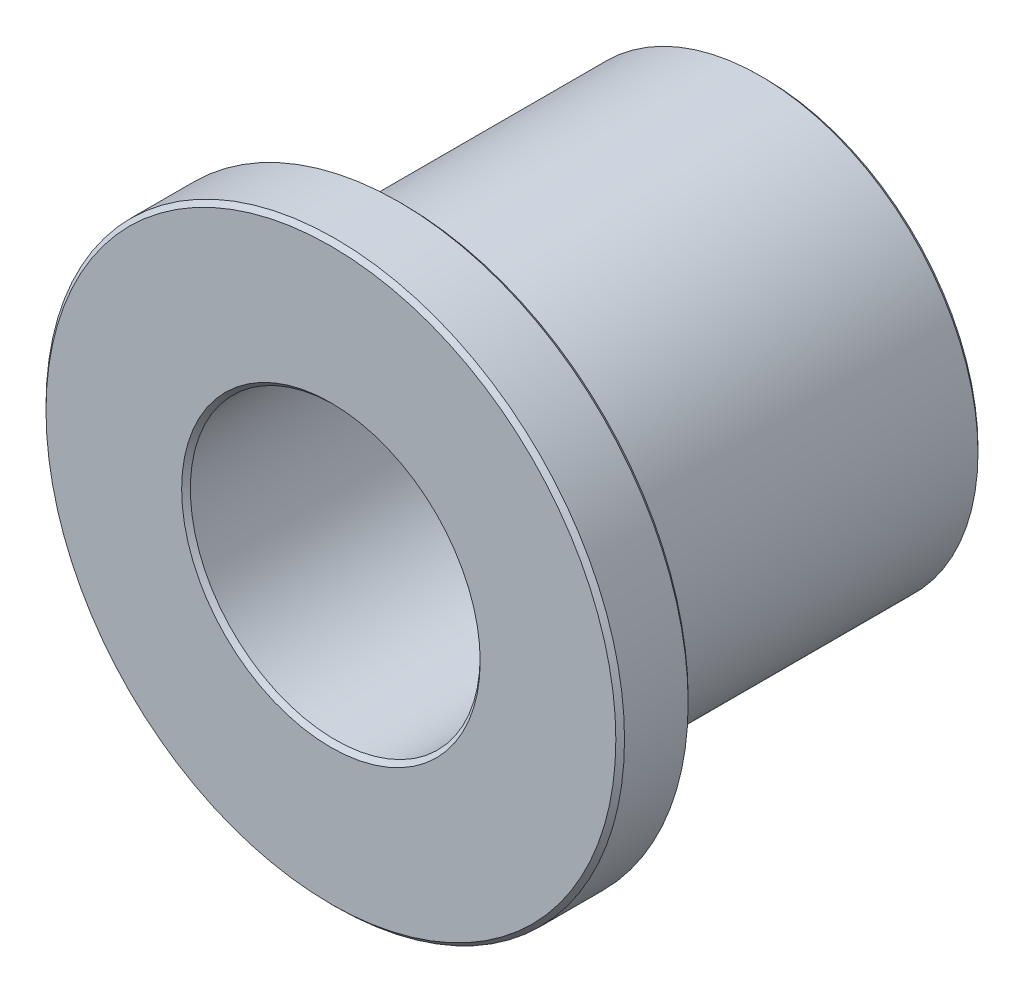
ISO-10303-21;
HEADER;
FILE_DESCRIPTION(('STEP AP214'),'2;1');
FILE_NAME('part.step','',(''),(''),'','','');
FILE_SCHEMA(('AUTOMOTIVE_DESIGN { 1 0 10303 214 1 1 1 1 }'));
ENDSEC;
DATA;
#1=APPLICATION_CONTEXT('core data for automotive mechanical design processes');
#2=APPLICATION_PROTOCOL_DEFINITION('international standard','automotive_design',2000,#1);
#3=PRODUCT_CONTEXT('',#1,'mechanical');
#4=PRODUCT('Part','Part','',(#3));
#5=PRODUCT_RELATED_PRODUCT_CATEGORY('part','',(#4));
#6=PRODUCT_DEFINITION_FORMATION('','',#4);
#7=PRODUCT_DEFINITION_CONTEXT('part definition',#1,'design');
#8=PRODUCT_DEFINITION('design','',#6,#7);
#9=PRODUCT_DEFINITION_SHAPE('','',#8);
#10=(LENGTH_UNIT() NAMED_UNIT(*) SI_UNIT(.MILLI.,.METRE.));
#11=(NAMED_UNIT(*) PLANE_ANGLE_UNIT() SI_UNIT($,.RADIAN.));
#12=(NAMED_UNIT(*) SI_UNIT($,.STERADIAN.) SOLID_ANGLE_UNIT());
#13=UNCERTAINTY_MEASURE_WITH_UNIT(LENGTH_MEASURE(1.E-05),#10,'distance_accuracy_value','');
#14=(GEOMETRIC_REPRESENTATION_CONTEXT(3) GLOBAL_UNCERTAINTY_ASSIGNED_CONTEXT((#13)) GLOBAL_UNIT_ASSIGNED_CONTEXT((#10,
#11,#12)) REPRESENTATION_CONTEXT('',''));
#15=CARTESIAN_POINT('',(0.,0.,0.));
#16=DIRECTION('',(0.,0.,1.));
#17=DIRECTION('',(1.,0.,0.));
#18=AXIS2_PLACEMENT_3D('',#15,#16,#17);
#19=CARTESIAN_POINT('',(0.,0.,6.35));
#20=DIRECTION('',(0.,0.,1.));
#21=DIRECTION('',(1.,0.,0.));
#22=AXIS2_PLACEMENT_3D('',#19,#20,#21);
#23=CYLINDRICAL_SURFACE('',#22,12.7);
#24=CARTESIAN_POINT('',(0.,0.,9.33411899999999));
#25=DIRECTION('',(0.,0.,1.));
#26=DIRECTION('',(1.,0.,0.));
#27=AXIS2_PLACEMENT_3D('',#24,#25,#26);
#28=CIRCLE('',#27,12.7);
#29=CARTESIAN_POINT('',(12.7,0.,9.33411899999999));
#30=VERTEX_POINT('',#29);
#31=EDGE_CURVE('E56',#30,#30,#28,.F.);
#32=ORIENTED_EDGE('',*,*,#31,.T.);
#33=EDGE_LOOP('',(#32));
#34=FACE_BOUND('',#33,.T.);
#35=CARTESIAN_POINT('',(0.,0.,6.540881));
#36=DIRECTION('',(0.,0.,1.));
#37=DIRECTION('',(1.,0.,0.));
#38=AXIS2_PLACEMENT_3D('',#35,#36,#37);
#39=CIRCLE('',#38,12.7);
#40=CARTESIAN_POINT('',(12.7,0.,6.540881));
#41=VERTEX_POINT('',#40);
#42=EDGE_CURVE('E59',#41,#41,#39,.T.);
#43=ORIENTED_EDGE('',*,*,#42,.T.);
#44=EDGE_LOOP('',(#43));
#45=FACE_BOUND('',#44,.T.);
#46=ADVANCED_FACE('F30',(#34,#45),#23,.T.);
#47=CARTESIAN_POINT('',(0.,0.,6.35));
#48=DIRECTION('',(0.,0.,1.));
#49=DIRECTION('',(1.,0.,0.));
#50=AXIS2_PLACEMENT_3D('',#47,#48,#49);
#51=PLANE('',#50);
#52=CARTESIAN_POINT('',(0.,0.,6.35));
#53=DIRECTION('',(0.,0.,1.));
#54=DIRECTION('',(1.,0.,0.));
#55=AXIS2_PLACEMENT_3D('',#52,#53,#54);
#56=CIRCLE('',#55,12.509119);
#57=CARTESIAN_POINT('',(12.509119,0.,6.35));
#58=VERTEX_POINT('',#57);
#59=EDGE_CURVE('E50',#58,#58,#56,.F.);
#60=ORIENTED_EDGE('',*,*,#59,.T.);
#61=EDGE_LOOP('',(#60));
#62=FACE_BOUND('',#61,.T.);
#63=CARTESIAN_POINT('',(0.,0.,6.35));
#64=DIRECTION('',(0.,0.,1.));
#65=DIRECTION('',(1.,0.,0.));
#66=AXIS2_PLACEMENT_3D('',#63,#64,#65);
#67=CIRCLE('',#66,9.741281);
#68=CARTESIAN_POINT('',(9.741281,0.,6.35));
#69=VERTEX_POINT('',#68);
#70=EDGE_CURVE('E53',#69,#69,#67,.T.);
#71=ORIENTED_EDGE('',*,*,#70,.T.);
#72=EDGE_LOOP('',(#71));
#73=FACE_BOUND('',#72,.T.);
#74=ADVANCED_FACE('F90',(#62,#73),#51,.F.);
#75=CARTESIAN_POINT('',(0.,0.,9.525));
#76=DIRECTION('',(0.,0.,1.));
#77=DIRECTION('',(1.,0.,0.));
#78=AXIS2_PLACEMENT_3D('',#75,#76,#77);
#79=PLANE('',#78);
#80=CARTESIAN_POINT('',(0.,0.,9.525));
#81=DIRECTION('',(0.,0.,1.));
#82=DIRECTION('',(1.,0.,0.));
#83=AXIS2_PLACEMENT_3D('',#80,#81,#82);
#84=CIRCLE('',#83,6.553581);
#85=CARTESIAN_POINT('',(6.553581,0.,9.525));
#86=VERTEX_POINT('',#85);
#87=EDGE_CURVE('E62',#86,#86,#84,.F.);
#88=ORIENTED_EDGE('',*,*,#87,.T.);
#89=EDGE_LOOP('',(#88));
#90=FACE_BOUND('',#89,.T.);
#91=CARTESIAN_POINT('',(0.,0.,9.525));
#92=DIRECTION('',(0.,0.,1.));
#93=DIRECTION('',(1.,0.,0.));
#94=AXIS2_PLACEMENT_3D('',#91,#92,#93);
#95=CIRCLE('',#94,12.509119);
#96=CARTESIAN_POINT('',(12.509119,0.,9.525));
#97=VERTEX_POINT('',#96);
#98=EDGE_CURVE('E65',#97,#97,#95,.T.);
#99=ORIENTED_EDGE('',*,*,#98,.T.);
#100=EDGE_LOOP('',(#99));
#101=FACE_BOUND('',#100,.T.);
#102=ADVANCED_FACE('F96',(#90,#101),#79,.T.);
#103=CARTESIAN_POINT('',(0.,0.,6.35));
#104=DIRECTION('',(0.,0.,1.));
#105=DIRECTION('',(1.,0.,0.));
#106=AXIS2_PLACEMENT_3D('',#103,#104,#105);
#107=CYLINDRICAL_SURFACE('',#106,6.3627);
#108=CARTESIAN_POINT('',(0.,0.,9.33411899999999));
#109=DIRECTION('',(0.,0.,1.));
#110=DIRECTION('',(1.,0.,0.));
#111=AXIS2_PLACEMENT_3D('',#108,#109,#110);
#112=CIRCLE('',#111,6.3627);
#113=CARTESIAN_POINT('',(6.3627,0.,9.33411899999999));
#114=VERTEX_POINT('',#113);
#115=EDGE_CURVE('E68',#114,#114,#112,.T.);
#116=ORIENTED_EDGE('',*,*,#115,.T.);
#117=EDGE_LOOP('',(#116));
#118=FACE_BOUND('',#117,.T.);
#119=CARTESIAN_POINT('',(0.,0.,-9.334119));
#120=DIRECTION('',(0.,0.,1.));
#121=DIRECTION('',(1.,0.,0.));
#122=AXIS2_PLACEMENT_3D('',#119,#120,#121);
#123=CIRCLE('',#122,6.3627);
#124=CARTESIAN_POINT('',(6.3627,0.,-9.334119));
#125=VERTEX_POINT('',#124);
#126=EDGE_CURVE('E71',#125,#125,#123,.F.);
#127=ORIENTED_EDGE('',*,*,#126,.T.);
#128=EDGE_LOOP('',(#127));
#129=FACE_BOUND('',#128,.T.);
#130=ADVANCED_FACE('F75',(#118,#129),#107,.F.);
#131=CARTESIAN_POINT('',(0.,0.,-9.525));
#132=DIRECTION('',(0.,0.,1.));
#133=DIRECTION('',(1.,0.,0.));
#134=AXIS2_PLACEMENT_3D('',#131,#132,#133);
#135=CYLINDRICAL_SURFACE('',#134,9.5504);
#136=CARTESIAN_POINT('',(0.,0.,6.15911899999999));
#137=DIRECTION('',(0.,0.,1.));
#138=DIRECTION('',(1.,0.,0.));
#139=AXIS2_PLACEMENT_3D('',#136,#137,#138);
#140=CIRCLE('',#139,9.5504);
#141=CARTESIAN_POINT('',(9.5504,0.,6.15911899999999));
#142=VERTEX_POINT('',#141);
#143=EDGE_CURVE('E41',#142,#142,#140,.F.);
#144=ORIENTED_EDGE('',*,*,#143,.T.);
#145=EDGE_LOOP('',(#144));
#146=FACE_BOUND('',#145,.T.);
#147=CARTESIAN_POINT('',(0.,0.,-9.334119));
#148=DIRECTION('',(0.,0.,1.));
#149=DIRECTION('',(1.,0.,0.));
#150=AXIS2_PLACEMENT_3D('',#147,#148,#149);
#151=CIRCLE('',#150,9.5504);
#152=CARTESIAN_POINT('',(9.5504,0.,-9.334119));
#153=VERTEX_POINT('',#152);
#154=EDGE_CURVE('E45',#153,#153,#151,.T.);
#155=ORIENTED_EDGE('',*,*,#154,.T.);
#156=EDGE_LOOP('',(#155));
#157=FACE_BOUND('',#156,.T.);
#158=ADVANCED_FACE('F158',(#146,#157),#135,.T.);
#159=CARTESIAN_POINT('',(0.,0.,-9.525));
#160=DIRECTION('',(0.,0.,1.));
#161=DIRECTION('',(1.,0.,0.));
#162=AXIS2_PLACEMENT_3D('',#159,#160,#161);
#163=PLANE('',#162);
#164=CARTESIAN_POINT('',(0.,0.,-9.525));
#165=DIRECTION('',(0.,0.,1.));
#166=DIRECTION('',(1.,0.,0.));
#167=AXIS2_PLACEMENT_3D('',#164,#165,#166);
#168=CIRCLE('',#167,6.553581);
#169=CARTESIAN_POINT('',(6.553581,0.,-9.525));
#170=VERTEX_POINT('',#169);
#171=EDGE_CURVE('E10',#170,#170,#168,.T.);
#172=ORIENTED_EDGE('',*,*,#171,.T.);
#173=EDGE_LOOP('',(#172));
#174=FACE_BOUND('',#173,.T.);
#175=CARTESIAN_POINT('',(0.,0.,-9.525));
#176=DIRECTION('',(0.,0.,1.));
#177=DIRECTION('',(1.,0.,0.));
#178=AXIS2_PLACEMENT_3D('',#175,#176,#177);
#179=CIRCLE('',#178,9.35951900000001);
#180=CARTESIAN_POINT('',(9.35951900000001,0.,-9.525));
#181=VERTEX_POINT('',#180);
#182=EDGE_CURVE('E37',#181,#181,#179,.F.);
#183=ORIENTED_EDGE('',*,*,#182,.T.);
#184=EDGE_LOOP('',(#183));
#185=FACE_BOUND('',#184,.T.);
#186=ADVANCED_FACE('F106',(#174,#185),#163,.F.);
#187=CARTESIAN_POINT('',(0.,0.,9.33411899999999));
#188=DIRECTION('',(0.,0.,1.));
#189=DIRECTION('',(1.,0.,0.));
#190=AXIS2_PLACEMENT_3D('',#187,#188,#189);
#191=CONICAL_SURFACE('',#190,6.3627,0.785398163397451);
#192=ORIENTED_EDGE('',*,*,#87,.F.);
#193=EDGE_LOOP('',(#192));
#194=FACE_BOUND('',#193,.T.);
#195=ORIENTED_EDGE('',*,*,#115,.F.);
#196=EDGE_LOOP('',(#195));
#197=FACE_BOUND('',#196,.T.);
#198=ADVANCED_FACE('F102',(#194,#197),#191,.F.);
#199=CARTESIAN_POINT('',(0.,0.,9.525));
#200=DIRECTION('',(0.,0.,-1.));
#201=DIRECTION('',(-1.,0.,0.));
#202=AXIS2_PLACEMENT_3D('',#199,#200,#201);
#203=CONICAL_SURFACE('',#202,12.509119,0.785398163397462);
#204=ORIENTED_EDGE('',*,*,#31,.F.);
#205=EDGE_LOOP('',(#204));
#206=FACE_BOUND('',#205,.T.);
#207=ORIENTED_EDGE('',*,*,#98,.F.);
#208=EDGE_LOOP('',(#207));
#209=FACE_BOUND('',#208,.T.);
#210=ADVANCED_FACE('F105',(#206,#209),#203,.T.);
#211=CARTESIAN_POINT('',(0.,0.,6.540881));
#212=DIRECTION('',(0.,0.,1.));
#213=DIRECTION('',(1.,0.,0.));
#214=AXIS2_PLACEMENT_3D('',#211,#212,#213);
#215=CONICAL_SURFACE('',#214,12.7,0.785398163397444);
#216=ORIENTED_EDGE('',*,*,#59,.F.);
#217=EDGE_LOOP('',(#216));
#218=FACE_BOUND('',#217,.T.);
#219=ORIENTED_EDGE('',*,*,#42,.F.);
#220=EDGE_LOOP('',(#219));
#221=FACE_BOUND('',#220,.T.);
#222=ADVANCED_FACE('F86',(#218,#221),#215,.T.);
#223=CARTESIAN_POINT('',(0.,0.,6.35));
#224=DIRECTION('',(0.,0.,1.));
#225=DIRECTION('',(1.,0.,0.));
#226=AXIS2_PLACEMENT_3D('',#223,#224,#225);
#227=CONICAL_SURFACE('',#226,9.741281,0.785398163397448);
#228=ORIENTED_EDGE('',*,*,#143,.F.);
#229=EDGE_LOOP('',(#228));
#230=FACE_BOUND('',#229,.T.);
#231=ORIENTED_EDGE('',*,*,#70,.F.);
#232=EDGE_LOOP('',(#231));
#233=FACE_BOUND('',#232,.T.);
#234=ADVANCED_FACE('F80',(#230,#233),#227,.T.);
#235=CARTESIAN_POINT('',(0.,0.,-9.525));
#236=DIRECTION('',(0.,0.,-1.));
#237=DIRECTION('',(-1.,0.,0.));
#238=AXIS2_PLACEMENT_3D('',#235,#236,#237);
#239=CONICAL_SURFACE('',#238,6.553581,0.785398163397446);
#240=ORIENTED_EDGE('',*,*,#126,.F.);
#241=EDGE_LOOP('',(#240));
#242=FACE_BOUND('',#241,.T.);
#243=ORIENTED_EDGE('',*,*,#171,.F.);
#244=EDGE_LOOP('',(#243));
#245=FACE_BOUND('',#244,.T.);
#246=ADVANCED_FACE('F77',(#242,#245),#239,.F.);
#247=CARTESIAN_POINT('',(0.,0.,-9.334119));
#248=DIRECTION('',(0.,0.,1.));
#249=DIRECTION('',(1.,0.,0.));
#250=AXIS2_PLACEMENT_3D('',#247,#248,#249);
#251=CONICAL_SURFACE('',#250,9.5504,0.785398163397435);
#252=ORIENTED_EDGE('',*,*,#182,.F.);
#253=EDGE_LOOP('',(#252));
#254=FACE_BOUND('',#253,.T.);
#255=ORIENTED_EDGE('',*,*,#154,.F.);
#256=EDGE_LOOP('',(#255));
#257=FACE_BOUND('',#256,.T.);
#258=ADVANCED_FACE('F32',(#254,#257),#251,.T.);
#259=CLOSED_SHELL('',(#46,#74,#102,#130,#158,#186,#198,#210,#222,#234,#246,#258));
#260=MANIFOLD_SOLID_BREP('B2',#259);
#261=ADVANCED_BREP_SHAPE_REPRESENTATION('',(#18,#260),#14);
#262=SHAPE_DEFINITION_REPRESENTATION(#9,#261);
ENDSEC;
END-ISO-10303-21;
